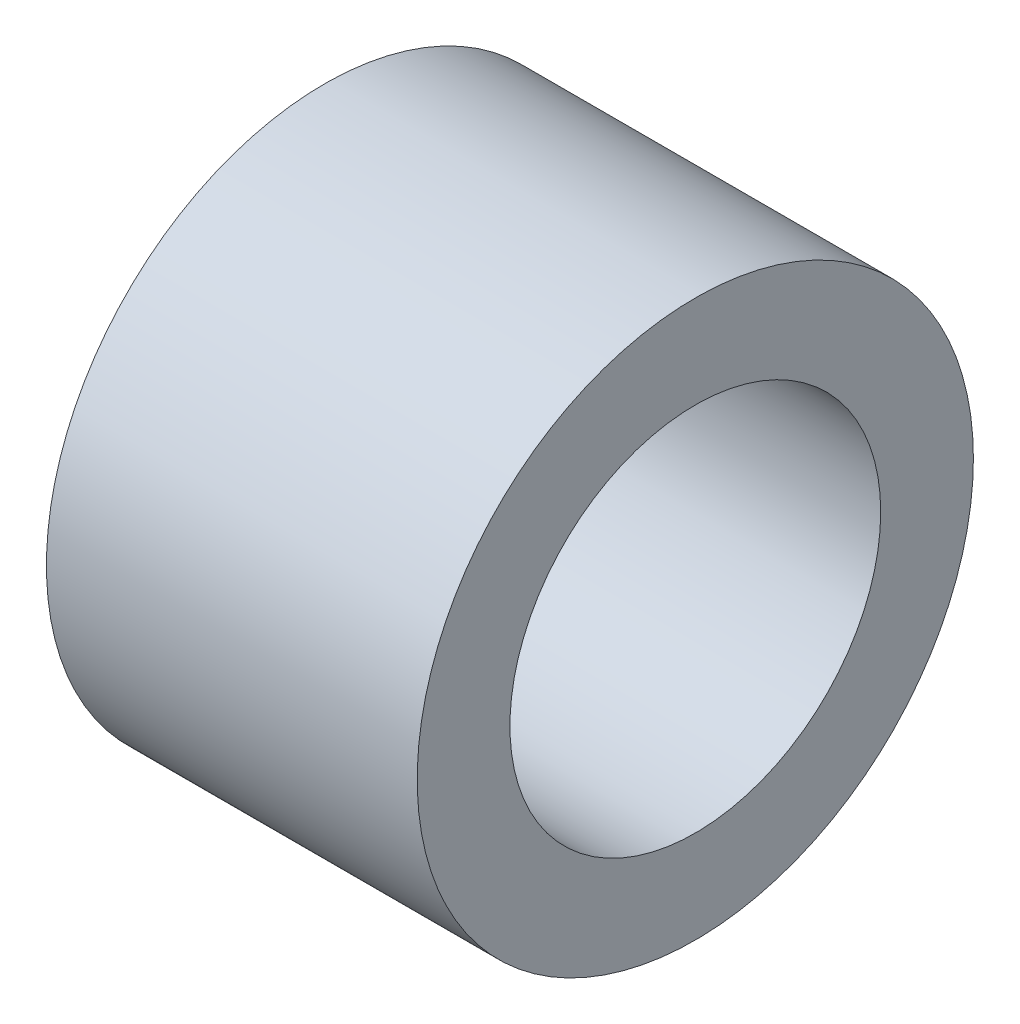
ISO-10303-21;
HEADER;
FILE_DESCRIPTION(('STEP AP214'),'2;1');
FILE_NAME('part.step','',(''),(''),'','','');
FILE_SCHEMA(('AUTOMOTIVE_DESIGN { 1 0 10303 214 1 1 1 1 }'));
ENDSEC;
DATA;
#1=APPLICATION_CONTEXT('core data for automotive mechanical design processes');
#2=APPLICATION_PROTOCOL_DEFINITION('international standard','automotive_design',2000,#1);
#3=PRODUCT_CONTEXT('',#1,'mechanical');
#4=PRODUCT('Part','Part','',(#3));
#5=PRODUCT_RELATED_PRODUCT_CATEGORY('part','',(#4));
#6=PRODUCT_DEFINITION_FORMATION('','',#4);
#7=PRODUCT_DEFINITION_CONTEXT('part definition',#1,'design');
#8=PRODUCT_DEFINITION('design','',#6,#7);
#9=PRODUCT_DEFINITION_SHAPE('','',#8);
#10=(LENGTH_UNIT() NAMED_UNIT(*) SI_UNIT(.MILLI.,.METRE.));
#11=(NAMED_UNIT(*) PLANE_ANGLE_UNIT() SI_UNIT($,.RADIAN.));
#12=(NAMED_UNIT(*) SI_UNIT($,.STERADIAN.) SOLID_ANGLE_UNIT());
#13=UNCERTAINTY_MEASURE_WITH_UNIT(LENGTH_MEASURE(1.E-05),#10,'distance_accuracy_value','');
#14=(GEOMETRIC_REPRESENTATION_CONTEXT(3) GLOBAL_UNCERTAINTY_ASSIGNED_CONTEXT((#13)) GLOBAL_UNIT_ASSIGNED_CONTEXT((#10,
#11,#12)) REPRESENTATION_CONTEXT('',''));
#15=CARTESIAN_POINT('',(0.,0.,0.));
#16=DIRECTION('',(0.,0.,1.));
#17=DIRECTION('',(1.,0.,0.));
#18=AXIS2_PLACEMENT_3D('',#15,#16,#17);
#19=CARTESIAN_POINT('',(10.,0.,0.));
#20=DIRECTION('',(1.,0.,0.));
#21=DIRECTION('',(0.,0.,-1.));
#22=AXIS2_PLACEMENT_3D('',#19,#20,#21);
#23=PLANE('',#22);
#24=CARTESIAN_POINT('',(10.,0.,0.));
#25=DIRECTION('',(1.,0.,0.));
#26=DIRECTION('',(0.,0.,-1.));
#27=AXIS2_PLACEMENT_3D('',#24,#25,#26);
#28=CIRCLE('',#27,7.5);
#29=CARTESIAN_POINT('',(10.,0.,-7.5));
#30=VERTEX_POINT('',#29);
#31=EDGE_CURVE('E10',#30,#30,#28,.T.);
#32=ORIENTED_EDGE('',*,*,#31,.T.);
#33=EDGE_LOOP('',(#32));
#34=FACE_BOUND('',#33,.T.);
#35=CARTESIAN_POINT('',(10.,0.,0.));
#36=DIRECTION('',(1.,0.,0.));
#37=DIRECTION('',(0.,0.,-1.));
#38=AXIS2_PLACEMENT_3D('',#35,#36,#37);
#39=CIRCLE('',#38,5.);
#40=CARTESIAN_POINT('',(10.,0.,-5.));
#41=VERTEX_POINT('',#40);
#42=EDGE_CURVE('E42',#41,#41,#39,.T.);
#43=ORIENTED_EDGE('',*,*,#42,.F.);
#44=EDGE_LOOP('',(#43));
#45=FACE_BOUND('',#44,.T.);
#46=ADVANCED_FACE('F31',(#34,#45),#23,.T.);
#47=CARTESIAN_POINT('',(0.,0.,0.));
#48=DIRECTION('',(1.,0.,0.));
#49=DIRECTION('',(0.,0.,-1.));
#50=AXIS2_PLACEMENT_3D('',#47,#48,#49);
#51=PLANE('',#50);
#52=CARTESIAN_POINT('',(0.,0.,0.));
#53=DIRECTION('',(1.,0.,0.));
#54=DIRECTION('',(0.,0.,-1.));
#55=AXIS2_PLACEMENT_3D('',#52,#53,#54);
#56=CIRCLE('',#55,7.5);
#57=CARTESIAN_POINT('',(0.,0.,-7.5));
#58=VERTEX_POINT('',#57);
#59=EDGE_CURVE('E35',#58,#58,#56,.T.);
#60=ORIENTED_EDGE('',*,*,#59,.F.);
#61=EDGE_LOOP('',(#60));
#62=FACE_BOUND('',#61,.T.);
#63=CARTESIAN_POINT('',(0.,0.,0.));
#64=DIRECTION('',(1.,0.,0.));
#65=DIRECTION('',(0.,0.,-1.));
#66=AXIS2_PLACEMENT_3D('',#63,#64,#65);
#67=CIRCLE('',#66,5.);
#68=CARTESIAN_POINT('',(0.,0.,-5.));
#69=VERTEX_POINT('',#68);
#70=EDGE_CURVE('E44',#69,#69,#67,.T.);
#71=ORIENTED_EDGE('',*,*,#70,.T.);
#72=EDGE_LOOP('',(#71));
#73=FACE_BOUND('',#72,.T.);
#74=ADVANCED_FACE('F54',(#62,#73),#51,.F.);
#75=CARTESIAN_POINT('',(10.,0.,0.));
#76=DIRECTION('',(-1.,0.,0.));
#77=DIRECTION('',(0.,0.,1.));
#78=AXIS2_PLACEMENT_3D('',#75,#76,#77);
#79=CYLINDRICAL_SURFACE('',#78,7.5);
#80=ORIENTED_EDGE('',*,*,#31,.F.);
#81=EDGE_LOOP('',(#80));
#82=FACE_BOUND('',#81,.T.);
#83=ORIENTED_EDGE('',*,*,#59,.T.);
#84=EDGE_LOOP('',(#83));
#85=FACE_BOUND('',#84,.T.);
#86=ADVANCED_FACE('F33',(#82,#85),#79,.T.);
#87=CARTESIAN_POINT('',(10.,0.,0.));
#88=DIRECTION('',(-1.,0.,0.));
#89=DIRECTION('',(0.,0.,1.));
#90=AXIS2_PLACEMENT_3D('',#87,#88,#89);
#91=CYLINDRICAL_SURFACE('',#90,5.);
#92=ORIENTED_EDGE('',*,*,#42,.T.);
#93=EDGE_LOOP('',(#92));
#94=FACE_BOUND('',#93,.T.);
#95=ORIENTED_EDGE('',*,*,#70,.F.);
#96=EDGE_LOOP('',(#95));
#97=FACE_BOUND('',#96,.T.);
#98=ADVANCED_FACE('F50',(#94,#97),#91,.F.);
#99=CLOSED_SHELL('',(#46,#74,#86,#98));
#100=MANIFOLD_SOLID_BREP('B2',#99);
#101=ADVANCED_BREP_SHAPE_REPRESENTATION('',(#18,#100),#14);
#102=SHAPE_DEFINITION_REPRESENTATION(#9,#101);
ENDSEC;
END-ISO-10303-21;
